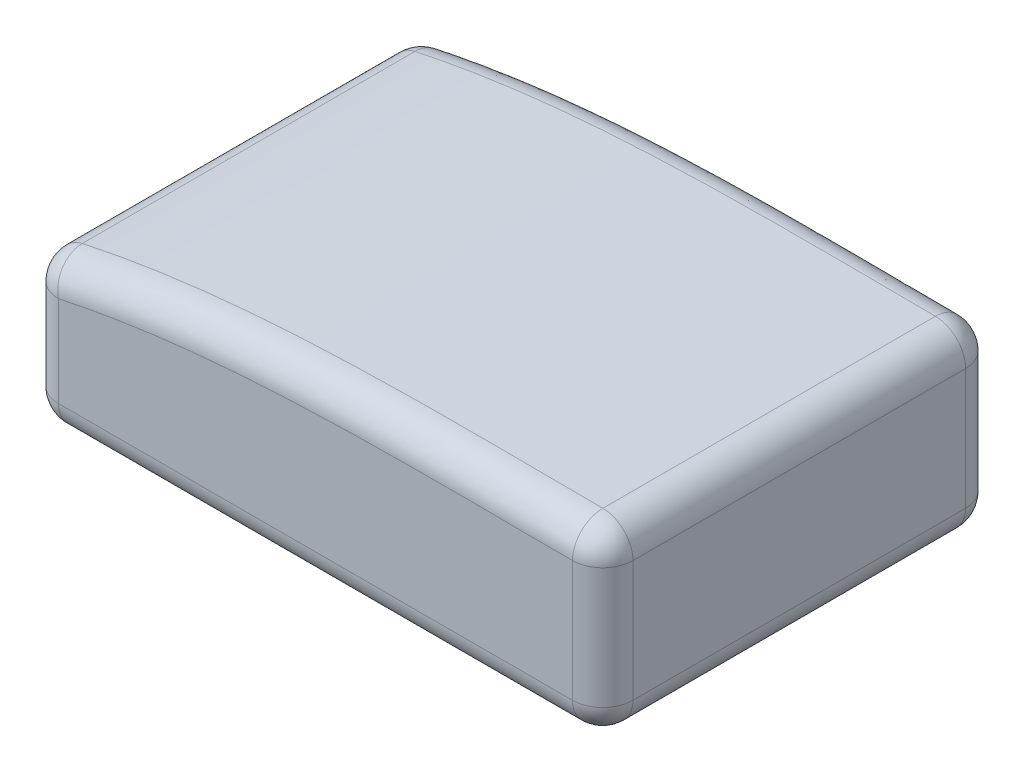
ISO-10303-21;
HEADER;
FILE_DESCRIPTION(('STEP AP214'),'2;1');
FILE_NAME('part.step','',(''),(''),'','','');
FILE_SCHEMA(('AUTOMOTIVE_DESIGN { 1 0 10303 214 1 1 1 1 }'));
ENDSEC;
DATA;
#1=APPLICATION_CONTEXT('core data for automotive mechanical design processes');
#2=APPLICATION_PROTOCOL_DEFINITION('international standard','automotive_design',2000,#1);
#3=PRODUCT_CONTEXT('',#1,'mechanical');
#4=PRODUCT('Part','Part','',(#3));
#5=PRODUCT_RELATED_PRODUCT_CATEGORY('part','',(#4));
#6=PRODUCT_DEFINITION_FORMATION('','',#4);
#7=PRODUCT_DEFINITION_CONTEXT('part definition',#1,'design');
#8=PRODUCT_DEFINITION('design','',#6,#7);
#9=PRODUCT_DEFINITION_SHAPE('','',#8);
#10=(LENGTH_UNIT() NAMED_UNIT(*) SI_UNIT(.MILLI.,.METRE.));
#11=(NAMED_UNIT(*) PLANE_ANGLE_UNIT() SI_UNIT($,.RADIAN.));
#12=(NAMED_UNIT(*) SI_UNIT($,.STERADIAN.) SOLID_ANGLE_UNIT());
#13=UNCERTAINTY_MEASURE_WITH_UNIT(LENGTH_MEASURE(1.E-05),#10,'distance_accuracy_value','');
#14=(GEOMETRIC_REPRESENTATION_CONTEXT(3) GLOBAL_UNCERTAINTY_ASSIGNED_CONTEXT((#13)) GLOBAL_UNIT_ASSIGNED_CONTEXT((#10,
#11,#12)) REPRESENTATION_CONTEXT('',''));
#15=CARTESIAN_POINT('',(0.,0.,0.));
#16=DIRECTION('',(0.,0.,1.));
#17=DIRECTION('',(1.,0.,0.));
#18=AXIS2_PLACEMENT_3D('',#15,#16,#17);
#19=CARTESIAN_POINT('',(42.5193725070978,13.0103957384489,65.));
#20=CARTESIAN_POINT('',(27.4250279443359,13.0688792368564,65.));
#21=CARTESIAN_POINT('',(-1.3524869377034,13.5789584870781,65.));
#22=CARTESIAN_POINT('',(-30.176694997044,10.789213783679,65.));
#23=CARTESIAN_POINT('',(-43.5555328411653,7.89973316323125,65.));
#24=B_SPLINE_CURVE_WITH_KNOTS('',3,(#19,#20,#21,#22,#23),.UNSPECIFIED.,.F.,.F.,(4,1,4),
(0.0423757194641037,0.517280324301563,0.947722655909291),.UNSPECIFIED.);
#25=DIRECTION('',(0.,0.,-1.));
#26=VECTOR('',#25,1.);
#27=SURFACE_OF_LINEAR_EXTRUSION('',#24,#26);
#28=DIRECTION('',(0.,0.,-1.));
#29=VECTOR('',#28,1.);
#30=CARTESIAN_POINT('',(-43.5555328411653,7.89973316323125,65.));
#31=LINE('',#30,#29);
#32=CARTESIAN_POINT('',(-43.5555328411653,7.89973316323125,60.));
#33=VERTEX_POINT('',#32);
#34=CARTESIAN_POINT('',(-43.5555328411653,7.89973316323125,5.));
#35=VERTEX_POINT('',#34);
#36=EDGE_CURVE('E130',#33,#35,#31,.T.);
#37=ORIENTED_EDGE('',*,*,#36,.F.);
#38=CARTESIAN_POINT('',(-64.1684996076384,-1.66741381157724,65.));
#39=CARTESIAN_POINT('',(-65.2240324488037,3.21990144541422,65.));
#40=CARTESIAN_POINT('',(-65.2240324488037,3.21990144541422,60.));
#41=CARTESIAN_POINT('',(-56.9456664050922,-0.10746990563823,65.));
#42=CARTESIAN_POINT('',(-58.0011991894325,4.77984536362596,65.));
#43=CARTESIAN_POINT('',(-58.0011991894325,4.77984536362596,60.));
#44=CARTESIAN_POINT('',(-49.7228332025461,1.45247400030078,65.));
#45=CARTESIAN_POINT('',(-50.7783659300613,6.3397892818377,65.));
#46=CARTESIAN_POINT('',(-50.7783659300613,6.3397892818377,60.));
#47=CARTESIAN_POINT('',(-42.5,3.01241790623979,65.));
#48=CARTESIAN_POINT('',(-43.5555326706901,7.89973320004944,65.));
#49=CARTESIAN_POINT('',(-43.5555326706901,7.89973320004944,60.));
#50=CARTESIAN_POINT('',(-40.6883249869007,3.40369775466802,65.));
#51=CARTESIAN_POINT('',(-41.690877148384,8.3024512855052,65.));
#52=CARTESIAN_POINT('',(-41.690877148384,8.3024512855052,60.));
#53=CARTESIAN_POINT('',(-38.8704986285983,3.76546903458196,65.));
#54=CARTESIAN_POINT('',(-39.8219613457611,8.67435991753743,65.));
#55=CARTESIAN_POINT('',(-39.8219613457611,8.67435991753743,60.));
#56=CARTESIAN_POINT('',(-35.2251351674717,4.43429615042569,65.));
#57=CARTESIAN_POINT('',(-36.078301643846,9.36122315270769,65.));
#58=CARTESIAN_POINT('',(-36.078301643846,9.3612231527077,60.));
#59=CARTESIAN_POINT('',(-33.397599941895,4.74136219378236,65.));
#60=CARTESIAN_POINT('',(-34.2035588983617,9.67618838105401,65.));
#61=CARTESIAN_POINT('',(-34.2035588983617,9.67618838105401,60.));
#62=CARTESIAN_POINT('',(-27.9100553753316,5.58611388666186,65.));
#63=CARTESIAN_POINT('',(-28.5805035902161,10.541804837865,65.));
#64=CARTESIAN_POINT('',(-28.5805035902161,10.5418048378651,60.));
#65=CARTESIAN_POINT('',(-24.2384076118663,6.0487638758694,65.));
#66=CARTESIAN_POINT('',(-24.8264683458662,11.0146271027254,65.));
#67=CARTESIAN_POINT('',(-24.8264683458662,11.0146271027254,60.));
#68=CARTESIAN_POINT('',(-16.8815871398132,6.80844358762731,65.));
#69=CARTESIAN_POINT('',(-17.3207144749072,11.7896846972338,65.));
#70=CARTESIAN_POINT('',(-17.3207144749072,11.7896846972338,60.));
#71=CARTESIAN_POINT('',(-13.1964266493163,7.10559734381575,65.));
#72=CARTESIAN_POINT('',(-13.5689962240616,12.0920477821616,65.));
#73=CARTESIAN_POINT('',(-13.5689962240616,12.0920477821616,60.));
#74=CARTESIAN_POINT('',(-5.81458880910727,7.56952327276952,65.));
#75=CARTESIAN_POINT('',(-6.0692061690897,12.5633852813018,65.));
#76=CARTESIAN_POINT('',(-6.0692061690897,12.5633852813018,60.));
#77=CARTESIAN_POINT('',(-2.11790367992939,7.73616639855911,65.));
#78=CARTESIAN_POINT('',(-2.32114162479617,12.7322276738357,65.));
#79=CARTESIAN_POINT('',(-2.32114162479617,12.7322276738357,60.));
#80=CARTESIAN_POINT('',(4.99304606779268,7.96293107733865,65.));
#81=CARTESIAN_POINT('',(4.87415831339454,12.9616808396549,65.));
#82=CARTESIAN_POINT('',(4.87415831339454,12.9616808396549,60.));
#83=CARTESIAN_POINT('',(8.40710418955931,8.03027667628953,65.));
#84=CARTESIAN_POINT('',(8.32230133344198,13.0296344611411,65.));
#85=CARTESIAN_POINT('',(8.32230133344199,13.0296344611411,60.));
#86=CARTESIAN_POINT('',(15.2361256387094,8.10835994540744,65.));
#87=CARTESIAN_POINT('',(15.2066039813001,13.1083486344166,65.));
#88=CARTESIAN_POINT('',(15.2066039813001,13.1083486344166,60.));
#89=CARTESIAN_POINT('',(18.6510890248159,8.11909120571364,65.));
#90=CARTESIAN_POINT('',(18.6427622081845,13.1191027100892,65.));
#91=CARTESIAN_POINT('',(18.6427622081845,13.1191027100892,60.));
#92=CARTESIAN_POINT('',(25.4721397507715,8.11025569942547,65.));
#93=CARTESIAN_POINT('',(25.4933916585057,13.1102358332741,65.));
#94=CARTESIAN_POINT('',(25.4933916585057,13.1102358332741,60.));
#95=CARTESIAN_POINT('',(28.8782274105892,8.0907665040848,65.));
#96=CARTESIAN_POINT('',(28.9078958920857,13.0906926492137,65.));
#97=CARTESIAN_POINT('',(28.9078958920857,13.0906926492137,60.));
#98=CARTESIAN_POINT('',(35.6895300816389,8.04742767134162,65.));
#99=CARTESIAN_POINT('',(35.7234501806973,13.0472993522144,65.));
#100=CARTESIAN_POINT('',(35.7234501806973,13.0472993522144,60.));
#101=CARTESIAN_POINT('',(39.094745098431,8.02357912380027,65.));
#102=CARTESIAN_POINT('',(39.1245033819221,13.0234503157796,65.));
#103=CARTESIAN_POINT('',(39.1245033819221,13.0234503157796,60.));
#104=CARTESIAN_POINT('',(42.5,8.01043326799292,65.));
#105=CARTESIAN_POINT('',(42.5193723764876,13.010395738955,65.));
#106=CARTESIAN_POINT('',(42.5193723764876,13.010395738955,60.));
#107=CARTESIAN_POINT('',(49.8893115226058,7.98180315511405,65.));
#108=CARTESIAN_POINT('',(49.9086839426302,12.9817656259074,65.));
#109=CARTESIAN_POINT('',(49.9086839426302,12.9817656259074,60.));
#110=CARTESIAN_POINT('',(57.2786230452117,7.95317304223518,65.));
#111=CARTESIAN_POINT('',(57.2979955087727,12.9531355128599,65.));
#112=CARTESIAN_POINT('',(57.2979955087727,12.9531355128599,60.));
#113=CARTESIAN_POINT('',(64.6679345678175,7.92454292935631,65.));
#114=CARTESIAN_POINT('',(64.6873070749153,12.9245053998123,65.));
#115=CARTESIAN_POINT('',(64.6873070749153,12.9245053998123,60.));
#116=(BOUNDED_SURFACE() B_SPLINE_SURFACE(3,2,((#38,#39,#40),(#41,#42,#43),(#44,#45,#46),(#47,
#48,#49),(#50,#51,#52),(#53,#54,#55),(#56,#57,#58),(#59,#60,#61),(#62,#63,#64),(#65,#66,#67),
(#68,#69,#70),(#71,#72,#73),(#74,#75,#76),(#77,#78,#79),(#80,#81,#82),(#83,#84,#85),(#86,#87,
#88),(#89,#90,#91),(#92,#93,#94),(#95,#96,#97),(#98,#99,#100),(#101,#102,#103),(#104,#105,#106),
(#107,#108,#109),(#110,#111,#112),(#113,#114,#115)),.UNSPECIFIED.,.F.,.F.,
.F.) B_SPLINE_SURFACE_WITH_KNOTS((4,3,2,2,2,2,2,2,2,2,3,4),(3,3),(0.,22.1681009595614,
27.7278495470315,33.286559654378,44.3834711905712,55.4720547492826,66.5715887406743,
76.8150976474696,87.05976629682,97.2781819578565,107.494046446124,129.662147405686),(0.,1.),
.UNSPECIFIED.) GEOMETRIC_REPRESENTATION_ITEM() RATIONAL_B_SPLINE_SURFACE(((1.,0.707106781186548,
1.),(1.,0.707106781186548,1.),(1.,0.707106781186548,1.),(1.,0.707106781186548,1.),(1.,
0.707106781186548,1.),(1.,0.707106781186548,1.),(1.,0.707106781186548,1.),(1.,0.707106781186548,
1.),(1.,0.707106781186548,1.),(1.,0.707106781186548,1.),(1.,0.707106781186548,1.),(1.,
0.707106781186548,1.),(1.,0.707106781186548,1.),(1.,0.707106781186548,1.),(1.,0.707106781186548,
1.),(1.,0.707106781186548,1.),(1.,0.707106781186548,1.),(1.,0.707106781186548,1.),(1.,
0.707106781186548,1.),(1.,0.707106781186548,1.),(1.,0.707106781186548,1.),(1.,0.707106781186548,
1.),(1.,0.707106781186548,1.),(1.,0.707106781186548,1.),(1.,0.707106781186548,1.),(1.,
0.707106781186548,1.))) REPRESENTATION_ITEM('') SURFACE());
#117=CARTESIAN_POINT('',(-65.2240324488037,3.21990144541422,60.));
#118=CARTESIAN_POINT('',(-58.0011991894325,4.77984536362596,60.));
#119=CARTESIAN_POINT('',(-50.7783659300613,6.3397892818377,60.));
#120=CARTESIAN_POINT('',(-43.5555326706901,7.89973320004944,60.));
#121=CARTESIAN_POINT('',(-41.690877148384,8.3024512855052,60.));
#122=CARTESIAN_POINT('',(-39.8219613457611,8.67435991753743,60.));
#123=CARTESIAN_POINT('',(-36.078301643846,9.3612231527077,60.));
#124=CARTESIAN_POINT('',(-34.2035588983617,9.67618838105401,60.));
#125=CARTESIAN_POINT('',(-28.5805035902161,10.5418048378651,60.));
#126=CARTESIAN_POINT('',(-24.8264683458662,11.0146271027254,60.));
#127=CARTESIAN_POINT('',(-17.3207144749072,11.7896846972338,60.));
#128=CARTESIAN_POINT('',(-13.5689962240616,12.0920477821616,60.));
#129=CARTESIAN_POINT('',(-6.0692061690897,12.5633852813018,60.));
#130=CARTESIAN_POINT('',(-2.32114162479616,12.7322276738357,60.));
#131=CARTESIAN_POINT('',(4.87415831339454,12.9616808396549,60.));
#132=CARTESIAN_POINT('',(8.32230133344198,13.0296344611411,60.));
#133=CARTESIAN_POINT('',(15.2066039813001,13.1083486344166,60.));
#134=CARTESIAN_POINT('',(18.6427622081845,13.1191027100892,60.));
#135=CARTESIAN_POINT('',(25.4933916585057,13.1102358332741,60.));
#136=CARTESIAN_POINT('',(28.9078958920857,13.0906926492137,60.));
#137=CARTESIAN_POINT('',(35.7234501806973,13.0472993522144,60.));
#138=CARTESIAN_POINT('',(39.1245033819221,13.0234503157796,60.));
#139=CARTESIAN_POINT('',(42.5193723764876,13.010395738955,60.));
#140=CARTESIAN_POINT('',(49.9086839426302,12.9817656259074,60.));
#141=CARTESIAN_POINT('',(57.2979955087727,12.9531355128599,60.));
#142=CARTESIAN_POINT('',(64.6873070749153,12.9245053998123,60.));
#143=B_SPLINE_CURVE_WITH_KNOTS('',3,(#117,#118,#119,#120,#121,#122,#123,#124,#125,#126,#127,
#128,#129,#130,#131,#132,#133,#134,#135,#136,#137,#138,#139,#140,#141,#142),.UNSPECIFIED.,.F.,
.F.,(4,3,2,2,2,2,2,2,2,2,3,4),(0.,22.1681009595614,27.7278495470315,33.286559654378,
44.3834711905712,55.4720547492826,66.5715887406743,76.8150976474696,87.05976629682,
97.2781819578565,107.494046446124,129.662147405686),.UNSPECIFIED.);
#144=CARTESIAN_POINT('',(42.5193725070978,13.0103957384489,60.));
#145=VERTEX_POINT('',#144);
#146=EDGE_CURVE('E11',#33,#145,#143,.T.);
#147=ORIENTED_EDGE('',*,*,#146,.T.);
#148=DIRECTION('',(0.,0.,-1.));
#149=VECTOR('',#148,1.);
#150=CARTESIAN_POINT('',(42.5193725070978,13.0103957384489,65.));
#151=LINE('',#150,#149);
#152=CARTESIAN_POINT('',(42.5193725070978,13.0103957384489,5.));
#153=VERTEX_POINT('',#152);
#154=EDGE_CURVE('E128',#145,#153,#151,.T.);
#155=ORIENTED_EDGE('',*,*,#154,.T.);
#156=CARTESIAN_POINT('',(64.6679345678175,7.92454292935631,0.));
#157=CARTESIAN_POINT('',(64.6873070749153,12.9245053998123,0.));
#158=CARTESIAN_POINT('',(64.6873070749153,12.9245053998123,5.));
#159=CARTESIAN_POINT('',(57.2786230452117,7.95317304223518,0.));
#160=CARTESIAN_POINT('',(57.2979955087727,12.9531355128599,0.));
#161=CARTESIAN_POINT('',(57.2979955087727,12.9531355128599,5.));
#162=CARTESIAN_POINT('',(49.8893115226058,7.98180315511405,0.));
#163=CARTESIAN_POINT('',(49.9086839426301,12.9817656259074,0.));
#164=CARTESIAN_POINT('',(49.9086839426302,12.9817656259074,5.));
#165=CARTESIAN_POINT('',(42.5,8.01043326799292,0.));
#166=CARTESIAN_POINT('',(42.5193723764876,13.010395738955,0.));
#167=CARTESIAN_POINT('',(42.5193723764876,13.010395738955,5.));
#168=CARTESIAN_POINT('',(40.6533901748153,8.01758502636916,0.));
#169=CARTESIAN_POINT('',(40.6783938437343,13.0175224737188,0.));
#170=CARTESIAN_POINT('',(40.6783938437343,13.0175224737188,5.));
#171=CARTESIAN_POINT('',(38.8068000912223,8.02786276093872,0.));
#172=CARTESIAN_POINT('',(38.8356053544071,13.0277795760225,0.));
#173=CARTESIAN_POINT('',(38.8356053544071,13.0277795760225,5.));
#174=CARTESIAN_POINT('',(35.1136368631675,8.05058957257012,0.));
#175=CARTESIAN_POINT('',(35.1463651323782,13.0504834369124,0.));
#176=CARTESIAN_POINT('',(35.1463651323782,13.0504834369124,5.));
#177=CARTESIAN_POINT('',(33.2670637186759,8.06303864448534,0.));
#178=CARTESIAN_POINT('',(33.2999134083693,13.0629301903085,0.));
#179=CARTESIAN_POINT('',(33.2999134083693,13.0629301903085,5.));
#180=CARTESIAN_POINT('',(27.7244132951857,8.097540178585,0.));
#181=CARTESIAN_POINT('',(27.7520731093711,13.0974665541508,0.));
#182=CARTESIAN_POINT('',(27.7520731093711,13.0974665541508,5.));
#183=CARTESIAN_POINT('',(24.028314433309,8.11672282996716,0.));
#184=CARTESIAN_POINT('',(24.0450998718973,13.1167282085901,0.));
#185=CARTESIAN_POINT('',(24.0450998718973,13.1167282085901,5.));
#186=CARTESIAN_POINT('',(16.6356184843341,8.11437344721049,0.));
#187=CARTESIAN_POINT('',(16.6156574690515,13.1143675643921,0.));
#188=CARTESIAN_POINT('',(16.6156574690515,13.1143675643921,5.));
#189=CARTESIAN_POINT('',(12.9390213830336,8.09283759146327,0.));
#190=CARTESIAN_POINT('',(12.8931868819038,13.0927414282585,0.));
#191=CARTESIAN_POINT('',(12.8931868819038,13.0927414282585,5.));
#192=CARTESIAN_POINT('',(7.39608975150484,8.0049635055429,0.));
#193=CARTESIAN_POINT('',(7.30013320769191,13.0040694633848,0.));
#194=CARTESIAN_POINT('',(7.30013320769191,13.0040694633848,5.));
#195=CARTESIAN_POINT('',(5.54933983942838,7.96643077483375,0.));
#196=CARTESIAN_POINT('',(5.43479808533109,12.9651605803283,0.));
#197=CARTESIAN_POINT('',(5.43479808533109,12.9651605803283,5.));
#198=CARTESIAN_POINT('',(1.85628337636942,7.86667222698596,0.));
#199=CARTESIAN_POINT('',(1.70080225801868,12.8642961391386,0.));
#200=CARTESIAN_POINT('',(1.70080225801868,12.8642961391386,4.99999999999999));
#201=CARTESIAN_POINT('',(0.0099768838683072,7.80544426306648,0.));
#202=CARTESIAN_POINT('',(-0.167858744886971,12.8023384007728,0.));
#203=CARTESIAN_POINT('',(-0.16785874488697,12.8023384007728,4.99999999999999));
#204=CARTESIAN_POINT('',(-5.24247842777396,7.59302166471239,0.));
#205=CARTESIAN_POINT('',(-5.48924071907995,12.5871312629167,0.));
#206=CARTESIAN_POINT('',(-5.48924071907995,12.5871312629167,4.99999999999998));
#207=CARTESIAN_POINT('',(-8.64744924868214,7.40953160788949,0.));
#208=CARTESIAN_POINT('',(-8.94527778511859,12.4009878464982,0.));
#209=CARTESIAN_POINT('',(-8.94527778511859,12.4009878464982,4.99999999999999));
#210=CARTESIAN_POINT('',(-15.448504495166,6.92483662243095,0.));
#211=CARTESIAN_POINT('',(-15.8615370948347,11.9080822062344,0.));
#212=CARTESIAN_POINT('',(-15.8615370948347,11.9080822062344,5.));
#213=CARTESIAN_POINT('',(-18.8445906552479,6.62365671495312,0.));
#214=CARTESIAN_POINT('',(-19.3217582931741,11.6013456207152,0.));
#215=CARTESIAN_POINT('',(-19.3217582931741,11.6013456207152,5.));
#216=CARTESIAN_POINT('',(-25.6329326959232,5.875106186254,0.));
#217=CARTESIAN_POINT('',(-26.2520426636702,10.8371444147979,0.));
#218=CARTESIAN_POINT('',(-26.2520426636702,10.8371444147979,5.));
#219=CARTESIAN_POINT('',(-29.0251361695875,5.42724132823193,0.));
#220=CARTESIAN_POINT('',(-29.722099234682,10.3791701740272,0.));
#221=CARTESIAN_POINT('',(-29.722099234682,10.3791701740272,5.));
#222=CARTESIAN_POINT('',(-34.0942516822729,4.62501862801732,0.));
#223=CARTESIAN_POINT('',(-34.9181421806835,9.55685710526059,0.));
#224=CARTESIAN_POINT('',(-34.9181421806835,9.55685710526059,5.));
#225=CARTESIAN_POINT('',(-35.781544401869,4.33570737466889,0.));
#226=CARTESIAN_POINT('',(-36.6494583444452,9.2600233338327,0.));
#227=CARTESIAN_POINT('',(-36.6494583444452,9.2600233338327,5.));
#228=CARTESIAN_POINT('',(-39.1476480535183,3.71013336536946,0.));
#229=CARTESIAN_POINT('',(-40.1069134314507,8.61747116991568,0.));
#230=CARTESIAN_POINT('',(-40.1069134314507,8.61747116991568,5.));
#231=CARTESIAN_POINT('',(-40.8264576740327,3.37386356639039,0.));
#232=CARTESIAN_POINT('',(-41.8330515383256,8.27174544431933,0.));
#233=CARTESIAN_POINT('',(-41.8330515383256,8.27174544431933,5.));
#234=CARTESIAN_POINT('',(-42.5,3.01241790623979,0.));
#235=CARTESIAN_POINT('',(-43.5555326706901,7.89973320004944,0.));
#236=CARTESIAN_POINT('',(-43.5555326706901,7.89973320004944,5.));
#237=CARTESIAN_POINT('',(-49.7228332025461,1.45247400030078,0.));
#238=CARTESIAN_POINT('',(-50.7783659300613,6.3397892818377,0.));
#239=CARTESIAN_POINT('',(-50.7783659300613,6.3397892818377,5.));
#240=CARTESIAN_POINT('',(-56.9456664050922,-0.10746990563823,0.));
#241=CARTESIAN_POINT('',(-58.0011991894325,4.77984536362596,0.));
#242=CARTESIAN_POINT('',(-58.0011991894325,4.77984536362596,5.));
#243=CARTESIAN_POINT('',(-64.1684996076384,-1.66741381157724,0.));
#244=CARTESIAN_POINT('',(-65.2240324488037,3.21990144541422,0.));
#245=CARTESIAN_POINT('',(-65.2240324488037,3.21990144541422,5.));
#246=(BOUNDED_SURFACE() B_SPLINE_SURFACE(3,2,((#156,#157,#158),(#159,#160,#161),(#162,#163,
#164),(#165,#166,#167),(#168,#169,#170),(#171,#172,#173),(#174,#175,#176),(#177,#178,#179),
(#180,#181,#182),(#183,#184,#185),(#186,#187,#188),(#189,#190,#191),(#192,#193,#194),(#195,#196,
#197),(#198,#199,#200),(#201,#202,#203),(#204,#205,#206),(#207,#208,#209),(#210,#211,#212),
(#213,#214,#215),(#216,#217,#218),(#219,#220,#221),(#222,#223,#224),(#225,#226,#227),(#228,#229,
#230),(#231,#232,#233),(#234,#235,#236),(#237,#238,#239),(#240,#241,#242),(#243,#244,#245)),
.UNSPECIFIED.,.F.,.F.,.F.) B_SPLINE_SURFACE_WITH_KNOTS((4,3,2,2,2,2,2,2,2,2,2,2,3,4),(3,3),(0.,
22.1681009595615,27.7079594955517,33.2478049008578,44.3362242332178,55.4256843134565,
60.9670131571261,66.5088662983651,76.7369064017634,86.9627731802002,97.2234554387105,
102.358609478235,107.494534537302,129.662635496864),(0.,1.),
.UNSPECIFIED.) GEOMETRIC_REPRESENTATION_ITEM() RATIONAL_B_SPLINE_SURFACE(((1.,0.707106781186547,
1.),(1.,0.707106781186547,1.),(1.,0.707106781186547,1.),(1.,0.707106781186547,1.),(1.,
0.707106781186548,1.),(1.,0.707106781186548,1.),(1.,0.707106781186548,1.),(1.,0.707106781186548,
1.),(1.,0.707106781186548,1.),(1.,0.707106781186548,1.),(1.,0.707106781186548,1.),(1.,
0.707106781186548,1.),(1.,0.707106781186548,1.),(1.,0.707106781186548,1.),(1.,0.707106781186548,
1.),(1.,0.707106781186548,1.),(1.,0.707106781186548,1.),(1.,0.707106781186548,1.),(1.,
0.707106781186548,1.),(1.,0.707106781186548,1.),(1.,0.707106781186548,1.),(1.,0.707106781186548,
1.),(1.,0.707106781186548,1.),(1.,0.707106781186548,1.),(1.,0.707106781186548,1.),(1.,
0.707106781186548,1.),(1.,0.707106781186548,1.),(1.,0.707106781186548,1.),(1.,0.707106781186548,
1.),(1.,0.707106781186548,1.))) REPRESENTATION_ITEM('') SURFACE());
#247=CARTESIAN_POINT('',(64.6873070749153,12.9245053998123,5.));
#248=CARTESIAN_POINT('',(57.2979955087727,12.9531355128599,5.));
#249=CARTESIAN_POINT('',(49.9086839426302,12.9817656259074,5.));
#250=CARTESIAN_POINT('',(42.5193723764876,13.010395738955,5.));
#251=CARTESIAN_POINT('',(40.6783938437343,13.0175224737188,5.));
#252=CARTESIAN_POINT('',(38.8356053544071,13.0277795760225,5.));
#253=CARTESIAN_POINT('',(35.1463651323782,13.0504834369124,5.));
#254=CARTESIAN_POINT('',(33.2999134083693,13.0629301903085,5.));
#255=CARTESIAN_POINT('',(27.7520731093711,13.0974665541508,5.));
#256=CARTESIAN_POINT('',(24.0450998718973,13.1167282085901,5.));
#257=CARTESIAN_POINT('',(16.6156574690515,13.1143675643921,5.));
#258=CARTESIAN_POINT('',(12.8931868819038,13.0927414282585,5.));
#259=CARTESIAN_POINT('',(7.30013320769191,13.0040694633848,5.));
#260=CARTESIAN_POINT('',(5.43479808533109,12.9651605803283,5.));
#261=CARTESIAN_POINT('',(1.70080225801868,12.8642961391386,4.99999999999999));
#262=CARTESIAN_POINT('',(-0.16785874488697,12.8023384007728,4.99999999999999));
#263=CARTESIAN_POINT('',(-5.48924071907995,12.5871312629167,4.99999999999998));
#264=CARTESIAN_POINT('',(-8.94527778511859,12.4009878464982,4.99999999999999));
#265=CARTESIAN_POINT('',(-15.8615370948347,11.9080822062344,5.));
#266=CARTESIAN_POINT('',(-19.3217582931741,11.6013456207152,5.));
#267=CARTESIAN_POINT('',(-26.2520426636702,10.8371444147979,5.));
#268=CARTESIAN_POINT('',(-29.722099234682,10.3791701740272,5.));
#269=CARTESIAN_POINT('',(-34.9181421806835,9.55685710526059,5.));
#270=CARTESIAN_POINT('',(-36.6494583444452,9.2600233338327,5.));
#271=CARTESIAN_POINT('',(-40.1069134314507,8.61747116991568,5.));
#272=CARTESIAN_POINT('',(-41.8330515383256,8.27174544431933,5.));
#273=CARTESIAN_POINT('',(-43.5555326706901,7.89973320004944,5.));
#274=CARTESIAN_POINT('',(-50.7783659300613,6.3397892818377,5.));
#275=CARTESIAN_POINT('',(-58.0011991894325,4.77984536362596,5.));
#276=CARTESIAN_POINT('',(-65.2240324488037,3.21990144541422,5.));
#277=B_SPLINE_CURVE_WITH_KNOTS('',3,(#247,#248,#249,#250,#251,#252,#253,#254,#255,#256,#257,
#258,#259,#260,#261,#262,#263,#264,#265,#266,#267,#268,#269,#270,#271,#272,#273,#274,#275,#276),
.UNSPECIFIED.,.F.,.F.,(4,3,2,2,2,2,2,2,2,2,2,2,3,4),(0.,22.1681009595615,27.7079594955517,
33.2478049008578,44.3362242332178,55.4256843134565,60.9670131571261,66.5088662983651,
76.7369064017634,86.9627731802002,97.2234554387105,102.358609478235,107.494534537302,
129.662635496864),.UNSPECIFIED.);
#278=EDGE_CURVE('E42',#153,#35,#277,.T.);
#279=ORIENTED_EDGE('',*,*,#278,.T.);
#280=EDGE_LOOP('',(#37,#147,#155,#279));
#281=FACE_BOUND('',#280,.T.);
#282=ADVANCED_FACE('F33',(#281),#27,.F.);
#283=CARTESIAN_POINT('',(-42.5,3.01241790623979,65.));
#284=DIRECTION('',(0.,0.,-1.));
#285=DIRECTION('',(-1.,0.,0.));
#286=AXIS2_PLACEMENT_3D('',#283,#284,#285);
#287=CYLINDRICAL_SURFACE('',#286,5.);
#288=DIRECTION('',(0.,0.,-1.));
#289=VECTOR('',#288,1.);
#290=CARTESIAN_POINT('',(-47.5,3.01241790623979,65.));
#291=LINE('',#290,#289);
#292=CARTESIAN_POINT('',(-47.5,3.01241790623979,60.));
#293=VERTEX_POINT('',#292);
#294=CARTESIAN_POINT('',(-47.5,3.01241790623979,5.));
#295=VERTEX_POINT('',#294);
#296=EDGE_CURVE('E217',#293,#295,#291,.T.);
#297=ORIENTED_EDGE('',*,*,#296,.F.);
#298=CARTESIAN_POINT('',(-42.5,3.01241790623979,60.));
#299=DIRECTION('',(0.,0.,-1.));
#300=DIRECTION('',(-1.,0.,0.));
#301=AXIS2_PLACEMENT_3D('',#298,#299,#300);
#302=CIRCLE('',#301,5.);
#303=EDGE_CURVE('E311',#293,#33,#302,.T.);
#304=ORIENTED_EDGE('',*,*,#303,.T.);
#305=ORIENTED_EDGE('',*,*,#36,.T.);
#306=CARTESIAN_POINT('',(-42.5,3.01241790623979,5.));
#307=DIRECTION('',(0.,0.,-1.));
#308=DIRECTION('',(-1.,0.,0.));
#309=AXIS2_PLACEMENT_3D('',#306,#307,#308);
#310=CIRCLE('',#309,5.);
#311=EDGE_CURVE('E327',#35,#295,#310,.F.);
#312=ORIENTED_EDGE('',*,*,#311,.T.);
#313=EDGE_LOOP('',(#297,#304,#305,#312));
#314=FACE_BOUND('',#313,.T.);
#315=ADVANCED_FACE('F191',(#314),#287,.T.);
#316=CARTESIAN_POINT('',(-47.5,-12.,65.));
#317=DIRECTION('',(1.,0.,0.));
#318=DIRECTION('',(0.,0.,-1.));
#319=AXIS2_PLACEMENT_3D('',#316,#317,#318);
#320=PLANE('',#319);
#321=DIRECTION('',(0.,0.,-1.));
#322=VECTOR('',#321,1.);
#323=CARTESIAN_POINT('',(-47.5,-12.,65.));
#324=LINE('',#323,#322);
#325=CARTESIAN_POINT('',(-47.5,-12.,60.));
#326=VERTEX_POINT('',#325);
#327=CARTESIAN_POINT('',(-47.5,-12.,5.));
#328=VERTEX_POINT('',#327);
#329=EDGE_CURVE('E214',#326,#328,#324,.T.);
#330=ORIENTED_EDGE('',*,*,#329,.F.);
#331=DIRECTION('',(0.,-1.,0.));
#332=VECTOR('',#331,1.);
#333=CARTESIAN_POINT('',(-47.5,3.01241790623979,60.));
#334=LINE('',#333,#332);
#335=EDGE_CURVE('E330',#326,#293,#334,.F.);
#336=ORIENTED_EDGE('',*,*,#335,.T.);
#337=ORIENTED_EDGE('',*,*,#296,.T.);
#338=DIRECTION('',(0.,-1.,0.));
#339=VECTOR('',#338,1.);
#340=CARTESIAN_POINT('',(-47.5,-12.,5.));
#341=LINE('',#340,#339);
#342=EDGE_CURVE('E375',#295,#328,#341,.T.);
#343=ORIENTED_EDGE('',*,*,#342,.T.);
#344=EDGE_LOOP('',(#330,#336,#337,#343));
#345=FACE_BOUND('',#344,.T.);
#346=ADVANCED_FACE('F380',(#345),#320,.F.);
#347=CARTESIAN_POINT('',(-42.5,-12.,65.));
#348=DIRECTION('',(0.,0.,-1.));
#349=DIRECTION('',(-1.,0.,0.));
#350=AXIS2_PLACEMENT_3D('',#347,#348,#349);
#351=CYLINDRICAL_SURFACE('',#350,5.);
#352=DIRECTION('',(0.,0.,-1.));
#353=VECTOR('',#352,1.);
#354=CARTESIAN_POINT('',(-42.5,-17.,65.));
#355=LINE('',#354,#353);
#356=CARTESIAN_POINT('',(-42.5,-17.,60.));
#357=VERTEX_POINT('',#356);
#358=CARTESIAN_POINT('',(-42.5,-17.,5.));
#359=VERTEX_POINT('',#358);
#360=EDGE_CURVE('E211',#357,#359,#355,.T.);
#361=ORIENTED_EDGE('',*,*,#360,.F.);
#362=CARTESIAN_POINT('',(-42.5,-12.,60.));
#363=DIRECTION('',(0.,0.,-1.));
#364=DIRECTION('',(-1.,0.,0.));
#365=AXIS2_PLACEMENT_3D('',#362,#363,#364);
#366=CIRCLE('',#365,5.);
#367=EDGE_CURVE('E373',#357,#326,#366,.T.);
#368=ORIENTED_EDGE('',*,*,#367,.T.);
#369=ORIENTED_EDGE('',*,*,#329,.T.);
#370=CARTESIAN_POINT('',(-42.5,-12.,5.));
#371=DIRECTION('',(0.,0.,-1.));
#372=DIRECTION('',(-1.,0.,0.));
#373=AXIS2_PLACEMENT_3D('',#370,#371,#372);
#374=CIRCLE('',#373,5.);
#375=EDGE_CURVE('E299',#328,#359,#374,.F.);
#376=ORIENTED_EDGE('',*,*,#375,.T.);
#377=EDGE_LOOP('',(#361,#368,#369,#376));
#378=FACE_BOUND('',#377,.T.);
#379=ADVANCED_FACE('F539',(#378),#351,.T.);
#380=CARTESIAN_POINT('',(-42.5,-17.,65.));
#381=DIRECTION('',(0.,1.,0.));
#382=DIRECTION('',(0.,0.,1.));
#383=AXIS2_PLACEMENT_3D('',#380,#381,#382);
#384=PLANE('',#383);
#385=DIRECTION('',(0.,0.,-1.));
#386=VECTOR('',#385,1.);
#387=CARTESIAN_POINT('',(42.5,-17.,65.));
#388=LINE('',#387,#386);
#389=CARTESIAN_POINT('',(42.5,-17.,60.));
#390=VERTEX_POINT('',#389);
#391=CARTESIAN_POINT('',(42.5,-17.,5.));
#392=VERTEX_POINT('',#391);
#393=EDGE_CURVE('E208',#390,#392,#388,.T.);
#394=ORIENTED_EDGE('',*,*,#393,.F.);
#395=DIRECTION('',(1.,0.,0.));
#396=VECTOR('',#395,1.);
#397=CARTESIAN_POINT('',(-42.5,-17.,60.));
#398=LINE('',#397,#396);
#399=EDGE_CURVE('E366',#390,#357,#398,.F.);
#400=ORIENTED_EDGE('',*,*,#399,.T.);
#401=ORIENTED_EDGE('',*,*,#360,.T.);
#402=DIRECTION('',(1.,0.,0.));
#403=VECTOR('',#402,1.);
#404=CARTESIAN_POINT('',(-42.5,-17.,5.));
#405=LINE('',#404,#403);
#406=EDGE_CURVE('E295',#359,#392,#405,.T.);
#407=ORIENTED_EDGE('',*,*,#406,.T.);
#408=EDGE_LOOP('',(#394,#400,#401,#407));
#409=FACE_BOUND('',#408,.T.);
#410=ADVANCED_FACE('F530',(#409),#384,.F.);
#411=CARTESIAN_POINT('',(42.5,-12.,65.));
#412=DIRECTION('',(0.,0.,-1.));
#413=DIRECTION('',(-1.,0.,0.));
#414=AXIS2_PLACEMENT_3D('',#411,#412,#413);
#415=CYLINDRICAL_SURFACE('',#414,5.);
#416=DIRECTION('',(0.,0.,-1.));
#417=VECTOR('',#416,1.);
#418=CARTESIAN_POINT('',(47.5,-12.,65.));
#419=LINE('',#418,#417);
#420=CARTESIAN_POINT('',(47.5,-12.,60.));
#421=VERTEX_POINT('',#420);
#422=CARTESIAN_POINT('',(47.5,-12.,5.));
#423=VERTEX_POINT('',#422);
#424=EDGE_CURVE('E205',#421,#423,#419,.T.);
#425=ORIENTED_EDGE('',*,*,#424,.F.);
#426=CARTESIAN_POINT('',(42.5,-12.,60.));
#427=DIRECTION('',(0.,0.,-1.));
#428=DIRECTION('',(-1.,0.,0.));
#429=AXIS2_PLACEMENT_3D('',#426,#427,#428);
#430=CIRCLE('',#429,5.);
#431=EDGE_CURVE('E360',#421,#390,#430,.T.);
#432=ORIENTED_EDGE('',*,*,#431,.T.);
#433=ORIENTED_EDGE('',*,*,#393,.T.);
#434=CARTESIAN_POINT('',(42.5,-12.,5.));
#435=DIRECTION('',(0.,0.,-1.));
#436=DIRECTION('',(-1.,0.,0.));
#437=AXIS2_PLACEMENT_3D('',#434,#435,#436);
#438=CIRCLE('',#437,5.);
#439=EDGE_CURVE('E364',#392,#423,#438,.F.);
#440=ORIENTED_EDGE('',*,*,#439,.T.);
#441=EDGE_LOOP('',(#425,#432,#433,#440));
#442=FACE_BOUND('',#441,.T.);
#443=ADVANCED_FACE('F414',(#442),#415,.T.);
#444=CARTESIAN_POINT('',(47.5,-12.,65.));
#445=DIRECTION('',(-1.,0.,0.));
#446=DIRECTION('',(0.,-1.,0.));
#447=AXIS2_PLACEMENT_3D('',#444,#445,#446);
#448=PLANE('',#447);
#449=DIRECTION('',(0.,0.,-1.));
#450=VECTOR('',#449,1.);
#451=CARTESIAN_POINT('',(47.5,8.01043326799293,65.));
#452=LINE('',#451,#450);
#453=CARTESIAN_POINT('',(47.5,8.01043326799293,60.));
#454=VERTEX_POINT('',#453);
#455=CARTESIAN_POINT('',(47.5,8.01043326799293,5.));
#456=VERTEX_POINT('',#455);
#457=EDGE_CURVE('E145',#454,#456,#452,.T.);
#458=ORIENTED_EDGE('',*,*,#457,.F.);
#459=DIRECTION('',(0.,1.,0.));
#460=VECTOR('',#459,1.);
#461=CARTESIAN_POINT('',(47.5,-12.,60.));
#462=LINE('',#461,#460);
#463=EDGE_CURVE('E354',#454,#421,#462,.F.);
#464=ORIENTED_EDGE('',*,*,#463,.T.);
#465=ORIENTED_EDGE('',*,*,#424,.T.);
#466=DIRECTION('',(0.,1.,0.));
#467=VECTOR('',#466,1.);
#468=CARTESIAN_POINT('',(47.5,-12.,5.));
#469=LINE('',#468,#467);
#470=EDGE_CURVE('E409',#423,#456,#469,.T.);
#471=ORIENTED_EDGE('',*,*,#470,.T.);
#472=EDGE_LOOP('',(#458,#464,#465,#471));
#473=FACE_BOUND('',#472,.T.);
#474=ADVANCED_FACE('F413',(#473),#448,.F.);
#475=CARTESIAN_POINT('',(42.5,8.01043326799292,65.));
#476=DIRECTION('',(0.,0.,-1.));
#477=DIRECTION('',(-1.,0.,0.));
#478=AXIS2_PLACEMENT_3D('',#475,#476,#477);
#479=CYLINDRICAL_SURFACE('',#478,5.);
#480=ORIENTED_EDGE('',*,*,#154,.F.);
#481=CARTESIAN_POINT('',(42.5,8.01043326799292,60.));
#482=DIRECTION('',(0.,0.,-1.));
#483=DIRECTION('',(-1.,0.,0.));
#484=AXIS2_PLACEMENT_3D('',#481,#482,#483);
#485=CIRCLE('',#484,5.);
#486=EDGE_CURVE('E141',#145,#454,#485,.T.);
#487=ORIENTED_EDGE('',*,*,#486,.T.);
#488=ORIENTED_EDGE('',*,*,#457,.T.);
#489=CARTESIAN_POINT('',(42.5,8.01043326799292,5.));
#490=DIRECTION('',(0.,0.,-1.));
#491=DIRECTION('',(-1.,0.,0.));
#492=AXIS2_PLACEMENT_3D('',#489,#490,#491);
#493=CIRCLE('',#492,5.);
#494=EDGE_CURVE('E144',#456,#153,#493,.F.);
#495=ORIENTED_EDGE('',*,*,#494,.T.);
#496=EDGE_LOOP('',(#480,#487,#488,#495));
#497=FACE_BOUND('',#496,.T.);
#498=ADVANCED_FACE('F139',(#497),#479,.T.);
#499=CARTESIAN_POINT('',(-0.656971124898234,12.7801164273168,65.));
#500=DIRECTION('',(0.,0.,1.));
#501=DIRECTION('',(1.,0.,0.));
#502=AXIS2_PLACEMENT_3D('',#499,#500,#501);
#503=PLANE('',#502);
#504=DIRECTION('',(1.,0.,0.));
#505=VECTOR('',#504,1.);
#506=CARTESIAN_POINT('',(42.5,-12.,65.));
#507=LINE('',#506,#505);
#508=CARTESIAN_POINT('',(-42.5,-12.,65.));
#509=VERTEX_POINT('',#508);
#510=CARTESIAN_POINT('',(42.5,-12.,65.));
#511=VERTEX_POINT('',#510);
#512=EDGE_CURVE('E408',#509,#511,#507,.T.);
#513=ORIENTED_EDGE('',*,*,#512,.T.);
#514=DIRECTION('',(0.,1.,0.));
#515=VECTOR('',#514,1.);
#516=CARTESIAN_POINT('',(42.5,8.01043326799293,65.));
#517=LINE('',#516,#515);
#518=CARTESIAN_POINT('',(42.5,8.01043326799292,65.));
#519=VERTEX_POINT('',#518);
#520=EDGE_CURVE('E355',#511,#519,#517,.T.);
#521=ORIENTED_EDGE('',*,*,#520,.T.);
#522=CARTESIAN_POINT('',(64.6679345678175,7.92454292935631,65.));
#523=CARTESIAN_POINT('',(57.2786230452117,7.95317304223518,65.));
#524=CARTESIAN_POINT('',(49.8893115226058,7.98180315511405,65.));
#525=CARTESIAN_POINT('',(42.5,8.01043326799292,65.));
#526=CARTESIAN_POINT('',(39.094745098431,8.02357912380028,65.));
#527=CARTESIAN_POINT('',(35.6895300816389,8.04742767134162,65.));
#528=CARTESIAN_POINT('',(28.8782274105892,8.0907665040848,65.));
#529=CARTESIAN_POINT('',(25.4721397507715,8.11025569942547,65.));
#530=CARTESIAN_POINT('',(18.6510890248159,8.11909120571364,65.));
#531=CARTESIAN_POINT('',(15.2361256387094,8.10835994540744,65.));
#532=CARTESIAN_POINT('',(8.4071041895593,8.03027667628953,65.));
#533=CARTESIAN_POINT('',(4.99304606779268,7.96293107733865,65.));
#534=CARTESIAN_POINT('',(-2.11790367992939,7.73616639855911,65.));
#535=CARTESIAN_POINT('',(-5.81458880910727,7.56952327276952,65.));
#536=CARTESIAN_POINT('',(-13.1964266493163,7.10559734381575,65.));
#537=CARTESIAN_POINT('',(-16.8815871398132,6.80844358762731,65.));
#538=CARTESIAN_POINT('',(-24.2384076118663,6.0487638758694,65.));
#539=CARTESIAN_POINT('',(-27.9100553753316,5.58611388666186,65.));
#540=CARTESIAN_POINT('',(-33.397599941895,4.74136219378236,65.));
#541=CARTESIAN_POINT('',(-35.2251351674717,4.43429615042569,65.));
#542=CARTESIAN_POINT('',(-38.8704986285983,3.76546903458196,65.));
#543=CARTESIAN_POINT('',(-40.6883249869007,3.40369775466802,65.));
#544=CARTESIAN_POINT('',(-42.5,3.01241790623979,65.));
#545=CARTESIAN_POINT('',(-49.7228332025461,1.45247400030078,65.));
#546=CARTESIAN_POINT('',(-56.9456664050922,-0.107469905638229,65.));
#547=CARTESIAN_POINT('',(-64.1684996076384,-1.66741381157724,65.));
#548=B_SPLINE_CURVE_WITH_KNOTS('',3,(#522,#523,#524,#525,#526,#527,#528,#529,#530,#531,#532,
#533,#534,#535,#536,#537,#538,#539,#540,#541,#542,#543,#544,#545,#546,#547),.UNSPECIFIED.,.F.,
.F.,(4,3,2,2,2,2,2,2,2,2,3,4),(0.,22.1681009595615,32.3839654478294,42.6023811088659,
52.8470497582163,63.0905586650116,74.1900926564033,85.2786762151147,96.3755877513079,
101.934297858654,107.494046446124,129.662147405686),.UNSPECIFIED.);
#549=CARTESIAN_POINT('',(-42.5,3.01241790623979,65.));
#550=VERTEX_POINT('',#549);
#551=EDGE_CURVE('E154',#519,#550,#548,.T.);
#552=ORIENTED_EDGE('',*,*,#551,.T.);
#553=DIRECTION('',(0.,-1.,0.));
#554=VECTOR('',#553,1.);
#555=CARTESIAN_POINT('',(-42.5,-12.,65.));
#556=LINE('',#555,#554);
#557=EDGE_CURVE('E227',#550,#509,#556,.T.);
#558=ORIENTED_EDGE('',*,*,#557,.T.);
#559=EDGE_LOOP('',(#513,#521,#552,#558));
#560=FACE_BOUND('',#559,.T.);
#561=ADVANCED_FACE('F229',(#560),#503,.T.);
#562=CARTESIAN_POINT('',(-0.656971124898234,12.7801164273168,0.));
#563=DIRECTION('',(0.,0.,1.));
#564=DIRECTION('',(1.,0.,0.));
#565=AXIS2_PLACEMENT_3D('',#562,#563,#564);
#566=PLANE('',#565);
#567=CARTESIAN_POINT('',(-64.1684996076384,-1.66741381157724,0.));
#568=CARTESIAN_POINT('',(-56.9456664050922,-0.10746990563823,0.));
#569=CARTESIAN_POINT('',(-49.7228332025461,1.45247400030078,0.));
#570=CARTESIAN_POINT('',(-42.5,3.01241790623979,0.));
#571=CARTESIAN_POINT('',(-40.8264576740327,3.37386356639039,0.));
#572=CARTESIAN_POINT('',(-39.1476480535183,3.71013336536946,0.));
#573=CARTESIAN_POINT('',(-35.781544401869,4.33570737466889,0.));
#574=CARTESIAN_POINT('',(-34.0942516822728,4.62501862801732,0.));
#575=CARTESIAN_POINT('',(-29.0251361695875,5.42724132823193,0.));
#576=CARTESIAN_POINT('',(-25.6329326959232,5.875106186254,0.));
#577=CARTESIAN_POINT('',(-18.8445906552479,6.62365671495312,0.));
#578=CARTESIAN_POINT('',(-15.448504495166,6.92483662243095,0.));
#579=CARTESIAN_POINT('',(-8.64744924868214,7.40953160788949,0.));
#580=CARTESIAN_POINT('',(-5.24247842777396,7.59302166471239,0.));
#581=CARTESIAN_POINT('',(0.00997688386830849,7.80544426306648,0.));
#582=CARTESIAN_POINT('',(1.85628337636942,7.86667222698596,0.));
#583=CARTESIAN_POINT('',(5.54933983942838,7.96643077483375,0.));
#584=CARTESIAN_POINT('',(7.39608975150484,8.0049635055429,0.));
#585=CARTESIAN_POINT('',(12.9390213830337,8.09283759146327,0.));
#586=CARTESIAN_POINT('',(16.6356184843341,8.11437344721049,0.));
#587=CARTESIAN_POINT('',(24.028314433309,8.11672282996716,0.));
#588=CARTESIAN_POINT('',(27.7244132951857,8.097540178585,0.));
#589=CARTESIAN_POINT('',(33.2670637186759,8.06303864448534,0.));
#590=CARTESIAN_POINT('',(35.1136368631675,8.05058957257012,0.));
#591=CARTESIAN_POINT('',(38.8068000912223,8.02786276093872,0.));
#592=CARTESIAN_POINT('',(40.6533901748153,8.01758502636916,0.));
#593=CARTESIAN_POINT('',(42.5,8.01043326799292,0.));
#594=CARTESIAN_POINT('',(49.8893115226058,7.98180315511405,0.));
#595=CARTESIAN_POINT('',(57.2786230452117,7.95317304223518,0.));
#596=CARTESIAN_POINT('',(64.6679345678175,7.92454292935631,0.));
#597=B_SPLINE_CURVE_WITH_KNOTS('',3,(#567,#568,#569,#570,#571,#572,#573,#574,#575,#576,#577,
#578,#579,#580,#581,#582,#583,#584,#585,#586,#587,#588,#589,#590,#591,#592,#593,#594,#595,#596),
.UNSPECIFIED.,.F.,.F.,(4,3,2,2,2,2,2,2,2,2,2,2,3,4),(0.,22.1681009595614,27.3040260186291,
32.4391800581531,42.6998623166635,52.9257290951002,63.1537691984986,68.6956223397376,
74.2369511834072,85.3264112636458,96.4148305960059,101.954676001312,107.494534537302,
129.662635496864),.UNSPECIFIED.);
#598=CARTESIAN_POINT('',(-42.5,3.01241790623979,0.));
#599=VERTEX_POINT('',#598);
#600=CARTESIAN_POINT('',(42.5,8.01043326799292,0.));
#601=VERTEX_POINT('',#600);
#602=EDGE_CURVE('E307',#599,#601,#597,.T.);
#603=ORIENTED_EDGE('',*,*,#602,.T.);
#604=DIRECTION('',(0.,1.,0.));
#605=VECTOR('',#604,1.);
#606=CARTESIAN_POINT('',(42.5,12.7801164273168,0.));
#607=LINE('',#606,#605);
#608=CARTESIAN_POINT('',(42.5,-12.,0.));
#609=VERTEX_POINT('',#608);
#610=EDGE_CURVE('E309',#601,#609,#607,.F.);
#611=ORIENTED_EDGE('',*,*,#610,.T.);
#612=DIRECTION('',(1.,0.,0.));
#613=VECTOR('',#612,1.);
#614=CARTESIAN_POINT('',(-0.656971124898234,-12.,0.));
#615=LINE('',#614,#613);
#616=CARTESIAN_POINT('',(-42.5,-12.,0.));
#617=VERTEX_POINT('',#616);
#618=EDGE_CURVE('E58',#609,#617,#615,.F.);
#619=ORIENTED_EDGE('',*,*,#618,.T.);
#620=DIRECTION('',(0.,-1.,0.));
#621=VECTOR('',#620,1.);
#622=CARTESIAN_POINT('',(-42.5,12.7801164273168,0.));
#623=LINE('',#622,#621);
#624=EDGE_CURVE('E303',#617,#599,#623,.F.);
#625=ORIENTED_EDGE('',*,*,#624,.T.);
#626=EDGE_LOOP('',(#603,#611,#619,#625));
#627=FACE_BOUND('',#626,.T.);
#628=ADVANCED_FACE('F233',(#627),#566,.F.);
#629=CARTESIAN_POINT('',(-42.5,-12.,60.));
#630=DIRECTION('',(0.,0.,1.));
#631=DIRECTION('',(1.,0.,0.));
#632=AXIS2_PLACEMENT_3D('',#629,#630,#631);
#633=SPHERICAL_SURFACE('',#632,5.);
#634=CARTESIAN_POINT('',(-42.5,-12.,60.));
#635=DIRECTION('',(0.,1.,0.));
#636=DIRECTION('',(-1.,0.,0.));
#637=AXIS2_PLACEMENT_3D('',#634,#635,#636);
#638=CIRCLE('',#637,5.);
#639=EDGE_CURVE('E341',#326,#509,#638,.T.);
#640=ORIENTED_EDGE('',*,*,#639,.F.);
#641=ORIENTED_EDGE('',*,*,#367,.F.);
#642=CARTESIAN_POINT('',(-42.5,-12.,60.));
#643=DIRECTION('',(1.,0.,0.));
#644=DIRECTION('',(0.,1.,0.));
#645=AXIS2_PLACEMENT_3D('',#642,#643,#644);
#646=CIRCLE('',#645,5.);
#647=EDGE_CURVE('E146',#509,#357,#646,.T.);
#648=ORIENTED_EDGE('',*,*,#647,.F.);
#649=EDGE_LOOP('',(#640,#641,#648));
#650=FACE_BOUND('',#649,.T.);
#651=ADVANCED_FACE('F397',(#650),#633,.T.);
#652=CARTESIAN_POINT('',(-0.656971124898234,-12.,60.));
#653=DIRECTION('',(-1.,0.,0.));
#654=DIRECTION('',(0.,0.,1.));
#655=AXIS2_PLACEMENT_3D('',#652,#653,#654);
#656=CYLINDRICAL_SURFACE('',#655,5.);
#657=ORIENTED_EDGE('',*,*,#647,.T.);
#658=ORIENTED_EDGE('',*,*,#399,.F.);
#659=CARTESIAN_POINT('',(42.5,-12.,60.));
#660=DIRECTION('',(1.,0.,0.));
#661=DIRECTION('',(0.,1.,0.));
#662=AXIS2_PLACEMENT_3D('',#659,#660,#661);
#663=CIRCLE('',#662,5.);
#664=EDGE_CURVE('E344',#511,#390,#663,.T.);
#665=ORIENTED_EDGE('',*,*,#664,.F.);
#666=ORIENTED_EDGE('',*,*,#512,.F.);
#667=EDGE_LOOP('',(#657,#658,#665,#666));
#668=FACE_BOUND('',#667,.T.);
#669=ADVANCED_FACE('F395',(#668),#656,.T.);
#670=CARTESIAN_POINT('',(-42.5,12.7801164273168,60.));
#671=DIRECTION('',(0.,1.,0.));
#672=DIRECTION('',(0.,0.,1.));
#673=AXIS2_PLACEMENT_3D('',#670,#671,#672);
#674=CYLINDRICAL_SURFACE('',#673,5.);
#675=ORIENTED_EDGE('',*,*,#639,.T.);
#676=ORIENTED_EDGE('',*,*,#557,.F.);
#677=CARTESIAN_POINT('',(-42.5,3.01241790623979,60.));
#678=DIRECTION('',(0.,1.,0.));
#679=DIRECTION('',(0.,0.,1.));
#680=AXIS2_PLACEMENT_3D('',#677,#678,#679);
#681=CIRCLE('',#680,5.);
#682=EDGE_CURVE('E346',#293,#550,#681,.T.);
#683=ORIENTED_EDGE('',*,*,#682,.F.);
#684=ORIENTED_EDGE('',*,*,#335,.F.);
#685=EDGE_LOOP('',(#675,#676,#683,#684));
#686=FACE_BOUND('',#685,.T.);
#687=ADVANCED_FACE('F384',(#686),#674,.T.);
#688=CARTESIAN_POINT('',(42.5,-12.,60.));
#689=DIRECTION('',(0.,0.,1.));
#690=DIRECTION('',(1.,0.,0.));
#691=AXIS2_PLACEMENT_3D('',#688,#689,#690);
#692=SPHERICAL_SURFACE('',#691,5.);
#693=ORIENTED_EDGE('',*,*,#664,.T.);
#694=ORIENTED_EDGE('',*,*,#431,.F.);
#695=CARTESIAN_POINT('',(42.5,-12.,60.));
#696=DIRECTION('',(0.,1.,0.));
#697=DIRECTION('',(-1.,0.,0.));
#698=AXIS2_PLACEMENT_3D('',#695,#696,#697);
#699=CIRCLE('',#698,5.);
#700=EDGE_CURVE('E171',#511,#421,#699,.T.);
#701=ORIENTED_EDGE('',*,*,#700,.F.);
#702=EDGE_LOOP('',(#693,#694,#701));
#703=FACE_BOUND('',#702,.T.);
#704=ADVANCED_FACE('F358',(#703),#692,.T.);
#705=CARTESIAN_POINT('',(-42.5,3.01241790623979,60.));
#706=DIRECTION('',(0.,0.,1.));
#707=DIRECTION('',(1.,0.,0.));
#708=AXIS2_PLACEMENT_3D('',#705,#706,#707);
#709=SPHERICAL_SURFACE('',#708,5.);
#710=ORIENTED_EDGE('',*,*,#303,.F.);
#711=ORIENTED_EDGE('',*,*,#682,.T.);
#712=CARTESIAN_POINT('',(-42.5,3.01241790623979,60.));
#713=DIRECTION('',(0.977463051398292,0.21110656823306,0.));
#714=DIRECTION('',(-0.21110656823306,0.977463051398292,0.));
#715=AXIS2_PLACEMENT_3D('',#712,#713,#714);
#716=CIRCLE('',#715,5.);
#717=EDGE_CURVE('E160',#33,#550,#716,.T.);
#718=ORIENTED_EDGE('',*,*,#717,.F.);
#719=EDGE_LOOP('',(#710,#711,#718));
#720=FACE_BOUND('',#719,.T.);
#721=ADVANCED_FACE('F385',(#720),#709,.T.);
#722=CARTESIAN_POINT('',(42.5,12.7801164273168,60.));
#723=DIRECTION('',(0.,-1.,0.));
#724=DIRECTION('',(1.,0.,0.));
#725=AXIS2_PLACEMENT_3D('',#722,#723,#724);
#726=CYLINDRICAL_SURFACE('',#725,5.);
#727=ORIENTED_EDGE('',*,*,#700,.T.);
#728=ORIENTED_EDGE('',*,*,#463,.F.);
#729=CARTESIAN_POINT('',(42.5,8.01043326799292,60.));
#730=DIRECTION('',(0.,1.,0.));
#731=DIRECTION('',(-1.,0.,0.));
#732=AXIS2_PLACEMENT_3D('',#729,#730,#731);
#733=CIRCLE('',#732,5.);
#734=EDGE_CURVE('E152',#519,#454,#733,.T.);
#735=ORIENTED_EDGE('',*,*,#734,.F.);
#736=ORIENTED_EDGE('',*,*,#520,.F.);
#737=EDGE_LOOP('',(#727,#728,#735,#736));
#738=FACE_BOUND('',#737,.T.);
#739=ADVANCED_FACE('F184',(#738),#726,.T.);
#740=ORIENTED_EDGE('',*,*,#717,.T.);
#741=ORIENTED_EDGE('',*,*,#551,.F.);
#742=CARTESIAN_POINT('',(42.5,8.01043326799292,60.));
#743=DIRECTION('',(0.999992494091205,-0.00387450141955264,0.));
#744=DIRECTION('',(0.00387450141955265,0.999992494091206,0.));
#745=AXIS2_PLACEMENT_3D('',#742,#743,#744);
#746=CIRCLE('',#745,5.);
#747=EDGE_CURVE('E150',#145,#519,#746,.T.);
#748=ORIENTED_EDGE('',*,*,#747,.F.);
#749=ORIENTED_EDGE('',*,*,#146,.F.);
#750=EDGE_LOOP('',(#740,#741,#748,#749));
#751=FACE_BOUND('',#750,.T.);
#752=ADVANCED_FACE('F157',(#751),#116,.T.);
#753=CARTESIAN_POINT('',(42.5,8.01043326799292,60.));
#754=DIRECTION('',(0.,0.,1.));
#755=DIRECTION('',(1.,0.,0.));
#756=AXIS2_PLACEMENT_3D('',#753,#754,#755);
#757=SPHERICAL_SURFACE('',#756,5.);
#758=ORIENTED_EDGE('',*,*,#734,.T.);
#759=ORIENTED_EDGE('',*,*,#486,.F.);
#760=ORIENTED_EDGE('',*,*,#747,.T.);
#761=EDGE_LOOP('',(#758,#759,#760));
#762=FACE_BOUND('',#761,.T.);
#763=ADVANCED_FACE('F149',(#762),#757,.T.);
#764=CARTESIAN_POINT('',(-42.5,-12.,5.));
#765=DIRECTION('',(0.,0.,1.));
#766=DIRECTION('',(1.,0.,0.));
#767=AXIS2_PLACEMENT_3D('',#764,#765,#766);
#768=SPHERICAL_SURFACE('',#767,5.);
#769=CARTESIAN_POINT('',(-42.5,-12.,5.));
#770=DIRECTION('',(0.,1.,0.));
#771=DIRECTION('',(-1.,0.,0.));
#772=AXIS2_PLACEMENT_3D('',#769,#770,#771);
#773=CIRCLE('',#772,5.);
#774=EDGE_CURVE('E162',#617,#328,#773,.T.);
#775=ORIENTED_EDGE('',*,*,#774,.F.);
#776=CARTESIAN_POINT('',(-42.5,-12.,5.));
#777=DIRECTION('',(1.,0.,0.));
#778=DIRECTION('',(0.,1.,0.));
#779=AXIS2_PLACEMENT_3D('',#776,#777,#778);
#780=CIRCLE('',#779,5.);
#781=EDGE_CURVE('E37',#359,#617,#780,.T.);
#782=ORIENTED_EDGE('',*,*,#781,.F.);
#783=ORIENTED_EDGE('',*,*,#375,.F.);
#784=EDGE_LOOP('',(#775,#782,#783));
#785=FACE_BOUND('',#784,.T.);
#786=ADVANCED_FACE('F35',(#785),#768,.T.);
#787=CARTESIAN_POINT('',(-42.5,-12.,5.));
#788=DIRECTION('',(1.,0.,0.));
#789=DIRECTION('',(0.,0.,-1.));
#790=AXIS2_PLACEMENT_3D('',#787,#788,#789);
#791=CYLINDRICAL_SURFACE('',#790,5.);
#792=ORIENTED_EDGE('',*,*,#781,.T.);
#793=ORIENTED_EDGE('',*,*,#618,.F.);
#794=CARTESIAN_POINT('',(42.5,-12.,5.));
#795=DIRECTION('',(1.,0.,0.));
#796=DIRECTION('',(0.,0.,-1.));
#797=AXIS2_PLACEMENT_3D('',#794,#795,#796);
#798=CIRCLE('',#797,5.);
#799=EDGE_CURVE('E301',#392,#609,#798,.T.);
#800=ORIENTED_EDGE('',*,*,#799,.F.);
#801=ORIENTED_EDGE('',*,*,#406,.F.);
#802=EDGE_LOOP('',(#792,#793,#800,#801));
#803=FACE_BOUND('',#802,.T.);
#804=ADVANCED_FACE('F283',(#803),#791,.T.);
#805=CARTESIAN_POINT('',(-42.5,-12.,5.));
#806=DIRECTION('',(0.,-1.,0.));
#807=DIRECTION('',(0.,0.,-1.));
#808=AXIS2_PLACEMENT_3D('',#805,#806,#807);
#809=CYLINDRICAL_SURFACE('',#808,5.);
#810=ORIENTED_EDGE('',*,*,#774,.T.);
#811=ORIENTED_EDGE('',*,*,#342,.F.);
#812=CARTESIAN_POINT('',(-42.5,3.01241790623979,5.));
#813=DIRECTION('',(0.,1.,0.));
#814=DIRECTION('',(0.,0.,1.));
#815=AXIS2_PLACEMENT_3D('',#812,#813,#814);
#816=CIRCLE('',#815,5.);
#817=EDGE_CURVE('E305',#599,#295,#816,.T.);
#818=ORIENTED_EDGE('',*,*,#817,.F.);
#819=ORIENTED_EDGE('',*,*,#624,.F.);
#820=EDGE_LOOP('',(#810,#811,#818,#819));
#821=FACE_BOUND('',#820,.T.);
#822=ADVANCED_FACE('F280',(#821),#809,.T.);
#823=CARTESIAN_POINT('',(42.5,-12.,5.));
#824=DIRECTION('',(0.,0.,1.));
#825=DIRECTION('',(1.,0.,0.));
#826=AXIS2_PLACEMENT_3D('',#823,#824,#825);
#827=SPHERICAL_SURFACE('',#826,5.);
#828=ORIENTED_EDGE('',*,*,#439,.F.);
#829=ORIENTED_EDGE('',*,*,#799,.T.);
#830=CARTESIAN_POINT('',(42.5,-12.,5.));
#831=DIRECTION('',(0.,1.,0.));
#832=DIRECTION('',(-1.,0.,0.));
#833=AXIS2_PLACEMENT_3D('',#830,#831,#832);
#834=CIRCLE('',#833,5.);
#835=EDGE_CURVE('E50',#423,#609,#834,.T.);
#836=ORIENTED_EDGE('',*,*,#835,.F.);
#837=EDGE_LOOP('',(#828,#829,#836));
#838=FACE_BOUND('',#837,.T.);
#839=ADVANCED_FACE('F276',(#838),#827,.T.);
#840=CARTESIAN_POINT('',(-42.5,3.01241790623979,5.));
#841=DIRECTION('',(0.,0.,1.));
#842=DIRECTION('',(1.,0.,0.));
#843=AXIS2_PLACEMENT_3D('',#840,#841,#842);
#844=SPHERICAL_SURFACE('',#843,5.);
#845=ORIENTED_EDGE('',*,*,#817,.T.);
#846=ORIENTED_EDGE('',*,*,#311,.F.);
#847=CARTESIAN_POINT('',(-42.5,3.01241790623979,5.));
#848=DIRECTION('',(0.977463051398292,0.21110656823306,0.));
#849=DIRECTION('',(-0.21110656823306,0.977463051398292,0.));
#850=AXIS2_PLACEMENT_3D('',#847,#848,#849);
#851=CIRCLE('',#850,5.);
#852=EDGE_CURVE('E266',#599,#35,#851,.T.);
#853=ORIENTED_EDGE('',*,*,#852,.F.);
#854=EDGE_LOOP('',(#845,#846,#853));
#855=FACE_BOUND('',#854,.T.);
#856=ADVANCED_FACE('F273',(#855),#844,.T.);
#857=CARTESIAN_POINT('',(42.5,-12.,5.));
#858=DIRECTION('',(0.,1.,0.));
#859=DIRECTION('',(-1.,0.,0.));
#860=AXIS2_PLACEMENT_3D('',#857,#858,#859);
#861=CYLINDRICAL_SURFACE('',#860,5.);
#862=ORIENTED_EDGE('',*,*,#835,.T.);
#863=ORIENTED_EDGE('',*,*,#610,.F.);
#864=CARTESIAN_POINT('',(42.5,8.01043326799293,5.));
#865=DIRECTION('',(0.,1.,0.));
#866=DIRECTION('',(0.,0.,1.));
#867=AXIS2_PLACEMENT_3D('',#864,#865,#866);
#868=CIRCLE('',#867,5.);
#869=EDGE_CURVE('E332',#456,#601,#868,.T.);
#870=ORIENTED_EDGE('',*,*,#869,.F.);
#871=ORIENTED_EDGE('',*,*,#470,.F.);
#872=EDGE_LOOP('',(#862,#863,#870,#871));
#873=FACE_BOUND('',#872,.T.);
#874=ADVANCED_FACE('F254',(#873),#861,.T.);
#875=ORIENTED_EDGE('',*,*,#852,.T.);
#876=ORIENTED_EDGE('',*,*,#278,.F.);
#877=CARTESIAN_POINT('',(42.5,8.01043326799292,5.));
#878=DIRECTION('',(0.999992494091206,-0.00387450141955126,0.));
#879=DIRECTION('',(0.00387450141955126,0.999992494091206,0.));
#880=AXIS2_PLACEMENT_3D('',#877,#878,#879);
#881=CIRCLE('',#880,5.);
#882=EDGE_CURVE('E334',#601,#153,#881,.T.);
#883=ORIENTED_EDGE('',*,*,#882,.F.);
#884=ORIENTED_EDGE('',*,*,#602,.F.);
#885=EDGE_LOOP('',(#875,#876,#883,#884));
#886=FACE_BOUND('',#885,.T.);
#887=ADVANCED_FACE('F247',(#886),#246,.T.);
#888=CARTESIAN_POINT('',(42.5,8.01043326799292,5.));
#889=DIRECTION('',(0.,0.,1.));
#890=DIRECTION('',(1.,0.,0.));
#891=AXIS2_PLACEMENT_3D('',#888,#889,#890);
#892=SPHERICAL_SURFACE('',#891,5.);
#893=ORIENTED_EDGE('',*,*,#494,.F.);
#894=ORIENTED_EDGE('',*,*,#869,.T.);
#895=ORIENTED_EDGE('',*,*,#882,.T.);
#896=EDGE_LOOP('',(#893,#894,#895));
#897=FACE_BOUND('',#896,.T.);
#898=ADVANCED_FACE('F253',(#897),#892,.T.);
#899=CLOSED_SHELL('',(#282,#315,#346,#379,#410,#443,#474,#498,#561,#628,#651,#669,#687,#704,
#721,#739,#752,#763,#786,#804,#822,#839,#856,#874,#887,#898));
#900=MANIFOLD_SOLID_BREP('B2',#899);
#901=ADVANCED_BREP_SHAPE_REPRESENTATION('',(#18,#900),#14);
#902=SHAPE_DEFINITION_REPRESENTATION(#9,#901);
ENDSEC;
END-ISO-10303-21;
